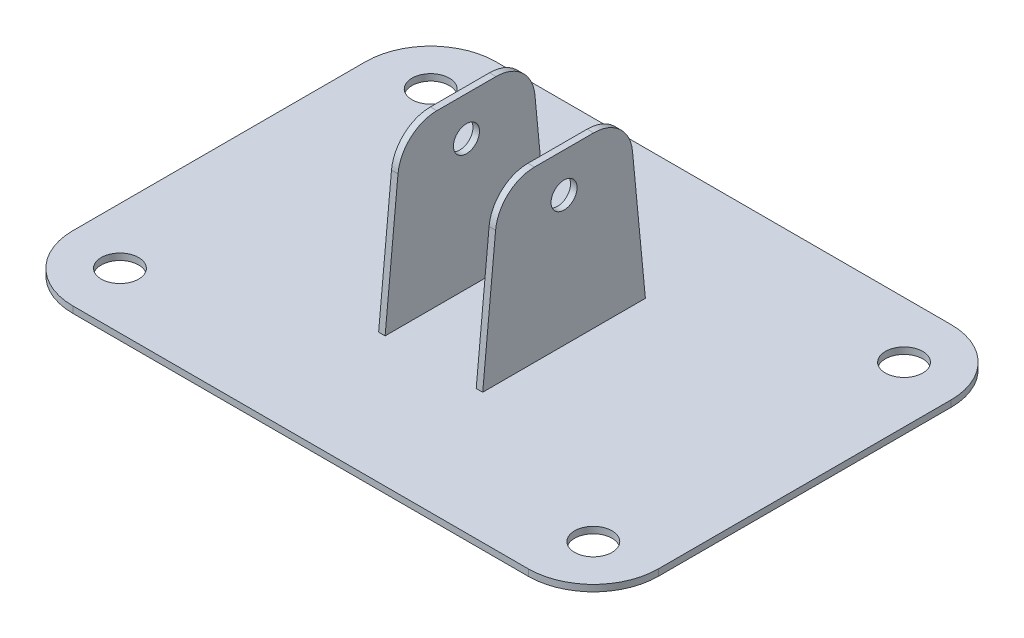
ISO-10303-21;
HEADER;
FILE_DESCRIPTION(('STEP AP214'),'2;1');
FILE_NAME('part.step','',(''),(''),'','','');
FILE_SCHEMA(('AUTOMOTIVE_DESIGN { 1 0 10303 214 1 1 1 1 }'));
ENDSEC;
DATA;
#1=APPLICATION_CONTEXT('core data for automotive mechanical design processes');
#2=APPLICATION_PROTOCOL_DEFINITION('international standard','automotive_design',2000,#1);
#3=PRODUCT_CONTEXT('',#1,'mechanical');
#4=PRODUCT('Part','Part','',(#3));
#5=PRODUCT_RELATED_PRODUCT_CATEGORY('part','',(#4));
#6=PRODUCT_DEFINITION_FORMATION('','',#4);
#7=PRODUCT_DEFINITION_CONTEXT('part definition',#1,'design');
#8=PRODUCT_DEFINITION('design','',#6,#7);
#9=PRODUCT_DEFINITION_SHAPE('','',#8);
#10=(LENGTH_UNIT() NAMED_UNIT(*) SI_UNIT(.MILLI.,.METRE.));
#11=(NAMED_UNIT(*) PLANE_ANGLE_UNIT() SI_UNIT($,.RADIAN.));
#12=(NAMED_UNIT(*) SI_UNIT($,.STERADIAN.) SOLID_ANGLE_UNIT());
#13=UNCERTAINTY_MEASURE_WITH_UNIT(LENGTH_MEASURE(1.E-05),#10,'distance_accuracy_value','');
#14=(GEOMETRIC_REPRESENTATION_CONTEXT(3) GLOBAL_UNCERTAINTY_ASSIGNED_CONTEXT((#13)) GLOBAL_UNIT_ASSIGNED_CONTEXT((#10,
#11,#12)) REPRESENTATION_CONTEXT('',''));
#15=CARTESIAN_POINT('',(0.,0.,0.));
#16=DIRECTION('',(0.,0.,1.));
#17=DIRECTION('',(1.,0.,0.));
#18=AXIS2_PLACEMENT_3D('',#15,#16,#17);
#19=CARTESIAN_POINT('',(0.,1.,0.));
#20=DIRECTION('',(0.,-1.,0.));
#21=DIRECTION('',(0.,0.,-1.));
#22=AXIS2_PLACEMENT_3D('',#19,#20,#21);
#23=PLANE('',#22);
#24=DIRECTION('',(0.,0.,-1.));
#25=VECTOR('',#24,1.);
#26=CARTESIAN_POINT('',(7.00000000000001,1.,12.5));
#27=LINE('',#26,#25);
#28=CARTESIAN_POINT('',(7.00000000000001,1.,12.5));
#29=VERTEX_POINT('',#28);
#30=CARTESIAN_POINT('',(7.00000000000001,1.,-12.5));
#31=VERTEX_POINT('',#30);
#32=EDGE_CURVE('E208',#29,#31,#27,.T.);
#33=ORIENTED_EDGE('',*,*,#32,.T.);
#34=DIRECTION('',(1.,0.,0.));
#35=VECTOR('',#34,1.);
#36=CARTESIAN_POINT('',(7.00000000000001,1.,-12.5));
#37=LINE('',#36,#35);
#38=CARTESIAN_POINT('',(8.00000000000001,1.,-12.5));
#39=VERTEX_POINT('',#38);
#40=EDGE_CURVE('E220',#31,#39,#37,.T.);
#41=ORIENTED_EDGE('',*,*,#40,.T.);
#42=DIRECTION('',(0.,0.,-1.));
#43=VECTOR('',#42,1.);
#44=CARTESIAN_POINT('',(8.00000000000001,1.,12.5));
#45=LINE('',#44,#43);
#46=CARTESIAN_POINT('',(8.00000000000001,1.,12.5));
#47=VERTEX_POINT('',#46);
#48=EDGE_CURVE('E205',#47,#39,#45,.T.);
#49=ORIENTED_EDGE('',*,*,#48,.F.);
#50=DIRECTION('',(1.,0.,0.));
#51=VECTOR('',#50,1.);
#52=CARTESIAN_POINT('',(7.00000000000001,1.,12.5));
#53=LINE('',#52,#51);
#54=EDGE_CURVE('E230',#29,#47,#53,.T.);
#55=ORIENTED_EDGE('',*,*,#54,.F.);
#56=EDGE_LOOP('',(#33,#41,#49,#55));
#57=FACE_BOUND('',#56,.T.);
#58=DIRECTION('',(0.,0.,1.));
#59=VECTOR('',#58,1.);
#60=CARTESIAN_POINT('',(-45.,1.,32.5));
#61=LINE('',#60,#59);
#62=CARTESIAN_POINT('',(-45.,1.,-22.5));
#63=VERTEX_POINT('',#62);
#64=CARTESIAN_POINT('',(-45.,1.,22.5));
#65=VERTEX_POINT('',#64);
#66=EDGE_CURVE('E267',#63,#65,#61,.T.);
#67=ORIENTED_EDGE('',*,*,#66,.T.);
#68=CARTESIAN_POINT('',(-35.,1.,22.5));
#69=DIRECTION('',(0.,-1.,0.));
#70=DIRECTION('',(0.,0.,-1.));
#71=AXIS2_PLACEMENT_3D('',#68,#69,#70);
#72=CIRCLE('',#71,10.);
#73=CARTESIAN_POINT('',(-35.,1.,32.5));
#74=VERTEX_POINT('',#73);
#75=EDGE_CURVE('E307',#65,#74,#72,.F.);
#76=ORIENTED_EDGE('',*,*,#75,.T.);
#77=DIRECTION('',(1.,0.,0.));
#78=VECTOR('',#77,1.);
#79=CARTESIAN_POINT('',(-45.,1.,32.5));
#80=LINE('',#79,#78);
#81=CARTESIAN_POINT('',(35.,1.,32.5));
#82=VERTEX_POINT('',#81);
#83=EDGE_CURVE('E270',#74,#82,#80,.T.);
#84=ORIENTED_EDGE('',*,*,#83,.T.);
#85=CARTESIAN_POINT('',(35.,1.,22.5));
#86=DIRECTION('',(0.,-1.,0.));
#87=DIRECTION('',(0.,0.,-1.));
#88=AXIS2_PLACEMENT_3D('',#85,#86,#87);
#89=CIRCLE('',#88,10.);
#90=CARTESIAN_POINT('',(45.,1.,22.5));
#91=VERTEX_POINT('',#90);
#92=EDGE_CURVE('E301',#82,#91,#89,.F.);
#93=ORIENTED_EDGE('',*,*,#92,.T.);
#94=DIRECTION('',(0.,0.,-1.));
#95=VECTOR('',#94,1.);
#96=CARTESIAN_POINT('',(45.,1.,32.5));
#97=LINE('',#96,#95);
#98=CARTESIAN_POINT('',(45.,1.,-22.5));
#99=VERTEX_POINT('',#98);
#100=EDGE_CURVE('E260',#91,#99,#97,.T.);
#101=ORIENTED_EDGE('',*,*,#100,.T.);
#102=CARTESIAN_POINT('',(35.,1.,-22.5));
#103=DIRECTION('',(0.,-1.,0.));
#104=DIRECTION('',(0.,0.,-1.));
#105=AXIS2_PLACEMENT_3D('',#102,#103,#104);
#106=CIRCLE('',#105,10.);
#107=CARTESIAN_POINT('',(35.,1.,-32.5));
#108=VERTEX_POINT('',#107);
#109=EDGE_CURVE('E303',#99,#108,#106,.F.);
#110=ORIENTED_EDGE('',*,*,#109,.T.);
#111=DIRECTION('',(-1.,0.,0.));
#112=VECTOR('',#111,1.);
#113=CARTESIAN_POINT('',(-45.,1.,-32.5));
#114=LINE('',#113,#112);
#115=CARTESIAN_POINT('',(-35.,1.,-32.5));
#116=VERTEX_POINT('',#115);
#117=EDGE_CURVE('E263',#108,#116,#114,.T.);
#118=ORIENTED_EDGE('',*,*,#117,.T.);
#119=CARTESIAN_POINT('',(-35.,1.,-22.5));
#120=DIRECTION('',(0.,-1.,0.));
#121=DIRECTION('',(0.,0.,-1.));
#122=AXIS2_PLACEMENT_3D('',#119,#120,#121);
#123=CIRCLE('',#122,10.);
#124=EDGE_CURVE('E305',#116,#63,#123,.F.);
#125=ORIENTED_EDGE('',*,*,#124,.T.);
#126=EDGE_LOOP('',(#67,#76,#84,#93,#101,#110,#118,#125));
#127=FACE_BOUND('',#126,.T.);
#128=CARTESIAN_POINT('',(-36.375,1.,-23.875));
#129=DIRECTION('',(0.,1.,0.));
#130=DIRECTION('',(0.,0.,1.));
#131=AXIS2_PLACEMENT_3D('',#128,#129,#130);
#132=CIRCLE('',#131,2.875);
#133=CARTESIAN_POINT('',(-36.375,1.,-21.));
#134=VERTEX_POINT('',#133);
#135=EDGE_CURVE('E254',#134,#134,#132,.T.);
#136=ORIENTED_EDGE('',*,*,#135,.F.);
#137=EDGE_LOOP('',(#136));
#138=FACE_BOUND('',#137,.T.);
#139=CARTESIAN_POINT('',(36.375,1.,-23.875));
#140=DIRECTION('',(0.,1.,0.));
#141=DIRECTION('',(0.,0.,-1.));
#142=AXIS2_PLACEMENT_3D('',#139,#140,#141);
#143=CIRCLE('',#142,2.875);
#144=CARTESIAN_POINT('',(36.375,1.,-26.75));
#145=VERTEX_POINT('',#144);
#146=EDGE_CURVE('E248',#145,#145,#143,.T.);
#147=ORIENTED_EDGE('',*,*,#146,.F.);
#148=EDGE_LOOP('',(#147));
#149=FACE_BOUND('',#148,.T.);
#150=CARTESIAN_POINT('',(36.375,1.,23.875));
#151=DIRECTION('',(0.,1.,0.));
#152=DIRECTION('',(0.,0.,1.));
#153=AXIS2_PLACEMENT_3D('',#150,#151,#152);
#154=CIRCLE('',#153,2.875);
#155=CARTESIAN_POINT('',(36.375,1.,26.75));
#156=VERTEX_POINT('',#155);
#157=EDGE_CURVE('E242',#156,#156,#154,.T.);
#158=ORIENTED_EDGE('',*,*,#157,.F.);
#159=EDGE_LOOP('',(#158));
#160=FACE_BOUND('',#159,.T.);
#161=CARTESIAN_POINT('',(-36.375,1.,23.875));
#162=DIRECTION('',(0.,1.,0.));
#163=DIRECTION('',(0.,0.,-1.));
#164=AXIS2_PLACEMENT_3D('',#161,#162,#163);
#165=CIRCLE('',#164,2.875);
#166=CARTESIAN_POINT('',(-36.375,1.,21.));
#167=VERTEX_POINT('',#166);
#168=EDGE_CURVE('E236',#167,#167,#165,.T.);
#169=ORIENTED_EDGE('',*,*,#168,.F.);
#170=EDGE_LOOP('',(#169));
#171=FACE_BOUND('',#170,.T.);
#172=DIRECTION('',(-1.,0.,0.));
#173=VECTOR('',#172,1.);
#174=CARTESIAN_POINT('',(-7.00000000000001,1.,-12.5));
#175=LINE('',#174,#173);
#176=CARTESIAN_POINT('',(-7.00000000000001,1.,-12.5));
#177=VERTEX_POINT('',#176);
#178=CARTESIAN_POINT('',(-8.00000000000001,1.,-12.5));
#179=VERTEX_POINT('',#178);
#180=EDGE_CURVE('E189',#177,#179,#175,.T.);
#181=ORIENTED_EDGE('',*,*,#180,.F.);
#182=DIRECTION('',(0.,0.,-1.));
#183=VECTOR('',#182,1.);
#184=CARTESIAN_POINT('',(-7.00000000000001,1.,12.5));
#185=LINE('',#184,#183);
#186=CARTESIAN_POINT('',(-7.00000000000001,1.,12.5));
#187=VERTEX_POINT('',#186);
#188=EDGE_CURVE('E176',#187,#177,#185,.T.);
#189=ORIENTED_EDGE('',*,*,#188,.F.);
#190=DIRECTION('',(-1.,0.,0.));
#191=VECTOR('',#190,1.);
#192=CARTESIAN_POINT('',(-7.00000000000001,1.,12.5));
#193=LINE('',#192,#191);
#194=CARTESIAN_POINT('',(-8.00000000000001,1.,12.5));
#195=VERTEX_POINT('',#194);
#196=EDGE_CURVE('E186',#187,#195,#193,.T.);
#197=ORIENTED_EDGE('',*,*,#196,.T.);
#198=DIRECTION('',(0.,0.,-1.));
#199=VECTOR('',#198,1.);
#200=CARTESIAN_POINT('',(-8.00000000000001,1.,12.5));
#201=LINE('',#200,#199);
#202=EDGE_CURVE('E363',#195,#179,#201,.T.);
#203=ORIENTED_EDGE('',*,*,#202,.T.);
#204=EDGE_LOOP('',(#181,#189,#197,#203));
#205=FACE_BOUND('',#204,.T.);
#206=ADVANCED_FACE('F33',(#57,#127,#138,#149,#160,#171,#205),#23,.F.);
#207=CARTESIAN_POINT('',(0.,0.,0.));
#208=DIRECTION('',(0.,-1.,0.));
#209=DIRECTION('',(0.,0.,-1.));
#210=AXIS2_PLACEMENT_3D('',#207,#208,#209);
#211=PLANE('',#210);
#212=CARTESIAN_POINT('',(36.375,0.,23.875));
#213=DIRECTION('',(0.,1.,0.));
#214=DIRECTION('',(0.,0.,1.));
#215=AXIS2_PLACEMENT_3D('',#212,#213,#214);
#216=CIRCLE('',#215,2.875);
#217=CARTESIAN_POINT('',(36.375,0.,26.75));
#218=VERTEX_POINT('',#217);
#219=EDGE_CURVE('E239',#218,#218,#216,.T.);
#220=ORIENTED_EDGE('',*,*,#219,.T.);
#221=EDGE_LOOP('',(#220));
#222=FACE_BOUND('',#221,.T.);
#223=CARTESIAN_POINT('',(-36.375,0.,-23.875));
#224=DIRECTION('',(0.,1.,0.));
#225=DIRECTION('',(0.,0.,1.));
#226=AXIS2_PLACEMENT_3D('',#223,#224,#225);
#227=CIRCLE('',#226,2.875);
#228=CARTESIAN_POINT('',(-36.375,0.,-21.));
#229=VERTEX_POINT('',#228);
#230=EDGE_CURVE('E251',#229,#229,#227,.T.);
#231=ORIENTED_EDGE('',*,*,#230,.T.);
#232=EDGE_LOOP('',(#231));
#233=FACE_BOUND('',#232,.T.);
#234=DIRECTION('',(1.,0.,0.));
#235=VECTOR('',#234,1.);
#236=CARTESIAN_POINT('',(-45.,0.,32.5));
#237=LINE('',#236,#235);
#238=CARTESIAN_POINT('',(-35.,0.,32.5));
#239=VERTEX_POINT('',#238);
#240=CARTESIAN_POINT('',(35.,0.,32.5));
#241=VERTEX_POINT('',#240);
#242=EDGE_CURVE('E264',#239,#241,#237,.T.);
#243=ORIENTED_EDGE('',*,*,#242,.F.);
#244=CARTESIAN_POINT('',(-35.,0.,22.5));
#245=DIRECTION('',(0.,-1.,0.));
#246=DIRECTION('',(0.,0.,-1.));
#247=AXIS2_PLACEMENT_3D('',#244,#245,#246);
#248=CIRCLE('',#247,10.);
#249=CARTESIAN_POINT('',(-45.,0.,22.5));
#250=VERTEX_POINT('',#249);
#251=EDGE_CURVE('E294',#239,#250,#248,.T.);
#252=ORIENTED_EDGE('',*,*,#251,.T.);
#253=DIRECTION('',(0.,0.,1.));
#254=VECTOR('',#253,1.);
#255=CARTESIAN_POINT('',(-45.,0.,32.5));
#256=LINE('',#255,#254);
#257=CARTESIAN_POINT('',(-45.,0.,-22.5));
#258=VERTEX_POINT('',#257);
#259=EDGE_CURVE('E279',#258,#250,#256,.T.);
#260=ORIENTED_EDGE('',*,*,#259,.F.);
#261=CARTESIAN_POINT('',(-35.,0.,-22.5));
#262=DIRECTION('',(0.,-1.,0.));
#263=DIRECTION('',(0.,0.,-1.));
#264=AXIS2_PLACEMENT_3D('',#261,#262,#263);
#265=CIRCLE('',#264,10.);
#266=CARTESIAN_POINT('',(-35.,0.,-32.5));
#267=VERTEX_POINT('',#266);
#268=EDGE_CURVE('E292',#258,#267,#265,.T.);
#269=ORIENTED_EDGE('',*,*,#268,.T.);
#270=DIRECTION('',(-1.,0.,0.));
#271=VECTOR('',#270,1.);
#272=CARTESIAN_POINT('',(-45.,0.,-32.5));
#273=LINE('',#272,#271);
#274=CARTESIAN_POINT('',(35.,0.,-32.5));
#275=VERTEX_POINT('',#274);
#276=EDGE_CURVE('E276',#275,#267,#273,.T.);
#277=ORIENTED_EDGE('',*,*,#276,.F.);
#278=CARTESIAN_POINT('',(35.,0.,-22.5));
#279=DIRECTION('',(0.,-1.,0.));
#280=DIRECTION('',(0.,0.,-1.));
#281=AXIS2_PLACEMENT_3D('',#278,#279,#280);
#282=CIRCLE('',#281,10.);
#283=CARTESIAN_POINT('',(45.,0.,-22.5));
#284=VERTEX_POINT('',#283);
#285=EDGE_CURVE('E290',#275,#284,#282,.T.);
#286=ORIENTED_EDGE('',*,*,#285,.T.);
#287=DIRECTION('',(0.,0.,-1.));
#288=VECTOR('',#287,1.);
#289=CARTESIAN_POINT('',(45.,0.,32.5));
#290=LINE('',#289,#288);
#291=CARTESIAN_POINT('',(45.,0.,22.5));
#292=VERTEX_POINT('',#291);
#293=EDGE_CURVE('E257',#292,#284,#290,.T.);
#294=ORIENTED_EDGE('',*,*,#293,.F.);
#295=CARTESIAN_POINT('',(35.,0.,22.5));
#296=DIRECTION('',(0.,-1.,0.));
#297=DIRECTION('',(0.,0.,-1.));
#298=AXIS2_PLACEMENT_3D('',#295,#296,#297);
#299=CIRCLE('',#298,10.);
#300=EDGE_CURVE('E288',#292,#241,#299,.T.);
#301=ORIENTED_EDGE('',*,*,#300,.T.);
#302=EDGE_LOOP('',(#243,#252,#260,#269,#277,#286,#294,#301));
#303=FACE_BOUND('',#302,.T.);
#304=CARTESIAN_POINT('',(36.375,0.,-23.875));
#305=DIRECTION('',(0.,1.,0.));
#306=DIRECTION('',(0.,0.,-1.));
#307=AXIS2_PLACEMENT_3D('',#304,#305,#306);
#308=CIRCLE('',#307,2.875);
#309=CARTESIAN_POINT('',(36.375,0.,-26.75));
#310=VERTEX_POINT('',#309);
#311=EDGE_CURVE('E245',#310,#310,#308,.T.);
#312=ORIENTED_EDGE('',*,*,#311,.T.);
#313=EDGE_LOOP('',(#312));
#314=FACE_BOUND('',#313,.T.);
#315=CARTESIAN_POINT('',(-36.375,0.,23.875));
#316=DIRECTION('',(0.,1.,0.));
#317=DIRECTION('',(0.,0.,-1.));
#318=AXIS2_PLACEMENT_3D('',#315,#316,#317);
#319=CIRCLE('',#318,2.875);
#320=CARTESIAN_POINT('',(-36.375,0.,21.));
#321=VERTEX_POINT('',#320);
#322=EDGE_CURVE('E233',#321,#321,#319,.T.);
#323=ORIENTED_EDGE('',*,*,#322,.T.);
#324=EDGE_LOOP('',(#323));
#325=FACE_BOUND('',#324,.T.);
#326=ADVANCED_FACE('F387',(#222,#233,#303,#314,#325),#211,.T.);
#327=CARTESIAN_POINT('',(45.,1.,32.5));
#328=DIRECTION('',(-1.,0.,0.));
#329=DIRECTION('',(0.,0.,1.));
#330=AXIS2_PLACEMENT_3D('',#327,#328,#329);
#331=PLANE('',#330);
#332=ORIENTED_EDGE('',*,*,#293,.T.);
#333=DIRECTION('',(0.,-1.,0.));
#334=VECTOR('',#333,1.);
#335=CARTESIAN_POINT('',(45.,1.,-22.5));
#336=LINE('',#335,#334);
#337=EDGE_CURVE('E317',#284,#99,#336,.F.);
#338=ORIENTED_EDGE('',*,*,#337,.T.);
#339=ORIENTED_EDGE('',*,*,#100,.F.);
#340=DIRECTION('',(0.,-1.,0.));
#341=VECTOR('',#340,1.);
#342=CARTESIAN_POINT('',(45.,1.,22.5));
#343=LINE('',#342,#341);
#344=EDGE_CURVE('E314',#91,#292,#343,.T.);
#345=ORIENTED_EDGE('',*,*,#344,.T.);
#346=EDGE_LOOP('',(#332,#338,#339,#345));
#347=FACE_BOUND('',#346,.T.);
#348=ADVANCED_FACE('F393',(#347),#331,.F.);
#349=CARTESIAN_POINT('',(-45.,1.,-32.5));
#350=DIRECTION('',(0.,0.,1.));
#351=DIRECTION('',(1.,0.,0.));
#352=AXIS2_PLACEMENT_3D('',#349,#350,#351);
#353=PLANE('',#352);
#354=ORIENTED_EDGE('',*,*,#276,.T.);
#355=DIRECTION('',(0.,-1.,0.));
#356=VECTOR('',#355,1.);
#357=CARTESIAN_POINT('',(-35.,1.,-32.5));
#358=LINE('',#357,#356);
#359=EDGE_CURVE('E312',#267,#116,#358,.F.);
#360=ORIENTED_EDGE('',*,*,#359,.T.);
#361=ORIENTED_EDGE('',*,*,#117,.F.);
#362=DIRECTION('',(0.,-1.,0.));
#363=VECTOR('',#362,1.);
#364=CARTESIAN_POINT('',(35.,1.,-32.5));
#365=LINE('',#364,#363);
#366=EDGE_CURVE('E309',#108,#275,#365,.T.);
#367=ORIENTED_EDGE('',*,*,#366,.T.);
#368=EDGE_LOOP('',(#354,#360,#361,#367));
#369=FACE_BOUND('',#368,.T.);
#370=ADVANCED_FACE('F408',(#369),#353,.F.);
#371=CARTESIAN_POINT('',(-45.,1.,32.5));
#372=DIRECTION('',(1.,0.,0.));
#373=DIRECTION('',(0.,0.,-1.));
#374=AXIS2_PLACEMENT_3D('',#371,#372,#373);
#375=PLANE('',#374);
#376=ORIENTED_EDGE('',*,*,#259,.T.);
#377=DIRECTION('',(0.,-1.,0.));
#378=VECTOR('',#377,1.);
#379=CARTESIAN_POINT('',(-45.,1.,22.5));
#380=LINE('',#379,#378);
#381=EDGE_CURVE('E299',#250,#65,#380,.F.);
#382=ORIENTED_EDGE('',*,*,#381,.T.);
#383=ORIENTED_EDGE('',*,*,#66,.F.);
#384=DIRECTION('',(0.,-1.,0.));
#385=VECTOR('',#384,1.);
#386=CARTESIAN_POINT('',(-45.,1.,-22.5));
#387=LINE('',#386,#385);
#388=EDGE_CURVE('E296',#63,#258,#387,.T.);
#389=ORIENTED_EDGE('',*,*,#388,.T.);
#390=EDGE_LOOP('',(#376,#382,#383,#389));
#391=FACE_BOUND('',#390,.T.);
#392=ADVANCED_FACE('F404',(#391),#375,.F.);
#393=CARTESIAN_POINT('',(-45.,1.,32.5));
#394=DIRECTION('',(0.,0.,-1.));
#395=DIRECTION('',(-1.,0.,0.));
#396=AXIS2_PLACEMENT_3D('',#393,#394,#395);
#397=PLANE('',#396);
#398=ORIENTED_EDGE('',*,*,#83,.F.);
#399=DIRECTION('',(0.,-1.,0.));
#400=VECTOR('',#399,1.);
#401=CARTESIAN_POINT('',(-35.,1.,32.5));
#402=LINE('',#401,#400);
#403=EDGE_CURVE('E285',#74,#239,#402,.T.);
#404=ORIENTED_EDGE('',*,*,#403,.T.);
#405=ORIENTED_EDGE('',*,*,#242,.T.);
#406=DIRECTION('',(0.,-1.,0.));
#407=VECTOR('',#406,1.);
#408=CARTESIAN_POINT('',(35.,1.,32.5));
#409=LINE('',#408,#407);
#410=EDGE_CURVE('E273',#241,#82,#409,.F.);
#411=ORIENTED_EDGE('',*,*,#410,.T.);
#412=EDGE_LOOP('',(#398,#404,#405,#411));
#413=FACE_BOUND('',#412,.T.);
#414=ADVANCED_FACE('F401',(#413),#397,.F.);
#415=CARTESIAN_POINT('',(-36.375,1.,-23.875));
#416=DIRECTION('',(0.,-1.,0.));
#417=DIRECTION('',(0.,0.,-1.));
#418=AXIS2_PLACEMENT_3D('',#415,#416,#417);
#419=CYLINDRICAL_SURFACE('',#418,2.875);
#420=ORIENTED_EDGE('',*,*,#135,.T.);
#421=EDGE_LOOP('',(#420));
#422=FACE_BOUND('',#421,.T.);
#423=ORIENTED_EDGE('',*,*,#230,.F.);
#424=EDGE_LOOP('',(#423));
#425=FACE_BOUND('',#424,.T.);
#426=ADVANCED_FACE('F398',(#422,#425),#419,.F.);
#427=CARTESIAN_POINT('',(36.375,1.,-23.875));
#428=DIRECTION('',(0.,-1.,0.));
#429=DIRECTION('',(0.,0.,-1.));
#430=AXIS2_PLACEMENT_3D('',#427,#428,#429);
#431=CYLINDRICAL_SURFACE('',#430,2.875);
#432=ORIENTED_EDGE('',*,*,#146,.T.);
#433=EDGE_LOOP('',(#432));
#434=FACE_BOUND('',#433,.T.);
#435=ORIENTED_EDGE('',*,*,#311,.F.);
#436=EDGE_LOOP('',(#435));
#437=FACE_BOUND('',#436,.T.);
#438=ADVANCED_FACE('F481',(#434,#437),#431,.F.);
#439=CARTESIAN_POINT('',(36.375,1.,23.875));
#440=DIRECTION('',(0.,-1.,0.));
#441=DIRECTION('',(0.,0.,-1.));
#442=AXIS2_PLACEMENT_3D('',#439,#440,#441);
#443=CYLINDRICAL_SURFACE('',#442,2.875);
#444=ORIENTED_EDGE('',*,*,#157,.T.);
#445=EDGE_LOOP('',(#444));
#446=FACE_BOUND('',#445,.T.);
#447=ORIENTED_EDGE('',*,*,#219,.F.);
#448=EDGE_LOOP('',(#447));
#449=FACE_BOUND('',#448,.T.);
#450=ADVANCED_FACE('F478',(#446,#449),#443,.F.);
#451=CARTESIAN_POINT('',(-36.375,1.,23.875));
#452=DIRECTION('',(0.,-1.,0.));
#453=DIRECTION('',(0.,0.,-1.));
#454=AXIS2_PLACEMENT_3D('',#451,#452,#453);
#455=CYLINDRICAL_SURFACE('',#454,2.875);
#456=ORIENTED_EDGE('',*,*,#168,.T.);
#457=EDGE_LOOP('',(#456));
#458=FACE_BOUND('',#457,.T.);
#459=ORIENTED_EDGE('',*,*,#322,.F.);
#460=EDGE_LOOP('',(#459));
#461=FACE_BOUND('',#460,.T.);
#462=ADVANCED_FACE('F420',(#458,#461),#455,.F.);
#463=CARTESIAN_POINT('',(-35.,1.,22.5));
#464=DIRECTION('',(0.,-1.,0.));
#465=DIRECTION('',(0.,0.,-1.));
#466=AXIS2_PLACEMENT_3D('',#463,#464,#465);
#467=CYLINDRICAL_SURFACE('',#466,10.);
#468=ORIENTED_EDGE('',*,*,#75,.F.);
#469=ORIENTED_EDGE('',*,*,#381,.F.);
#470=ORIENTED_EDGE('',*,*,#251,.F.);
#471=ORIENTED_EDGE('',*,*,#403,.F.);
#472=EDGE_LOOP('',(#468,#469,#470,#471));
#473=FACE_BOUND('',#472,.T.);
#474=ADVANCED_FACE('F416',(#473),#467,.T.);
#475=CARTESIAN_POINT('',(-35.,1.,-22.5));
#476=DIRECTION('',(0.,-1.,0.));
#477=DIRECTION('',(0.,0.,-1.));
#478=AXIS2_PLACEMENT_3D('',#475,#476,#477);
#479=CYLINDRICAL_SURFACE('',#478,10.);
#480=ORIENTED_EDGE('',*,*,#124,.F.);
#481=ORIENTED_EDGE('',*,*,#359,.F.);
#482=ORIENTED_EDGE('',*,*,#268,.F.);
#483=ORIENTED_EDGE('',*,*,#388,.F.);
#484=EDGE_LOOP('',(#480,#481,#482,#483));
#485=FACE_BOUND('',#484,.T.);
#486=ADVANCED_FACE('F419',(#485),#479,.T.);
#487=CARTESIAN_POINT('',(35.,1.,-22.5));
#488=DIRECTION('',(0.,-1.,0.));
#489=DIRECTION('',(0.,0.,-1.));
#490=AXIS2_PLACEMENT_3D('',#487,#488,#489);
#491=CYLINDRICAL_SURFACE('',#490,10.);
#492=ORIENTED_EDGE('',*,*,#109,.F.);
#493=ORIENTED_EDGE('',*,*,#337,.F.);
#494=ORIENTED_EDGE('',*,*,#285,.F.);
#495=ORIENTED_EDGE('',*,*,#366,.F.);
#496=EDGE_LOOP('',(#492,#493,#494,#495));
#497=FACE_BOUND('',#496,.T.);
#498=ADVANCED_FACE('F424',(#497),#491,.T.);
#499=CARTESIAN_POINT('',(35.,1.,22.5));
#500=DIRECTION('',(0.,-1.,0.));
#501=DIRECTION('',(0.,0.,-1.));
#502=AXIS2_PLACEMENT_3D('',#499,#500,#501);
#503=CYLINDRICAL_SURFACE('',#502,10.);
#504=ORIENTED_EDGE('',*,*,#92,.F.);
#505=ORIENTED_EDGE('',*,*,#410,.F.);
#506=ORIENTED_EDGE('',*,*,#300,.F.);
#507=ORIENTED_EDGE('',*,*,#344,.F.);
#508=EDGE_LOOP('',(#504,#505,#506,#507));
#509=FACE_BOUND('',#508,.T.);
#510=ADVANCED_FACE('F428',(#509),#503,.T.);
#511=CARTESIAN_POINT('',(7.00000000000001,1.,12.5));
#512=DIRECTION('',(0.,0.0957124066442578,0.995409029100281));
#513=DIRECTION('',(0.,-0.995409029100281,0.0957124066442578));
#514=AXIS2_PLACEMENT_3D('',#511,#512,#513);
#515=PLANE('',#514);
#516=DIRECTION('',(0.,-0.995409029100281,0.0957124066442578));
#517=VECTOR('',#516,1.);
#518=CARTESIAN_POINT('',(8.00000000000001,1.,12.5));
#519=LINE('',#518,#517);
#520=CARTESIAN_POINT('',(8.00000000000001,21.5742744398655,10.5217043807822));
#521=VERTEX_POINT('',#520);
#522=EDGE_CURVE('E212',#521,#47,#519,.T.);
#523=ORIENTED_EDGE('',*,*,#522,.F.);
#524=DIRECTION('',(1.,0.,0.));
#525=VECTOR('',#524,1.);
#526=CARTESIAN_POINT('',(7.00000000000001,21.5742744398655,10.5217043807822));
#527=LINE('',#526,#525);
#528=CARTESIAN_POINT('',(7.00000000000001,21.5742744398655,10.5217043807822));
#529=VERTEX_POINT('',#528);
#530=EDGE_CURVE('E328',#521,#529,#527,.F.);
#531=ORIENTED_EDGE('',*,*,#530,.T.);
#532=DIRECTION('',(0.,-0.995409029100281,0.0957124066442578));
#533=VECTOR('',#532,1.);
#534=CARTESIAN_POINT('',(7.00000000000001,1.,12.5));
#535=LINE('',#534,#533);
#536=EDGE_CURVE('E218',#529,#29,#535,.T.);
#537=ORIENTED_EDGE('',*,*,#536,.T.);
#538=ORIENTED_EDGE('',*,*,#54,.T.);
#539=EDGE_LOOP('',(#523,#531,#537,#538));
#540=FACE_BOUND('',#539,.T.);
#541=ADVANCED_FACE('F432',(#540),#515,.T.);
#542=CARTESIAN_POINT('',(7.00000000000001,27.,10.));
#543=DIRECTION('',(0.,1.,0.));
#544=DIRECTION('',(0.,0.,1.));
#545=AXIS2_PLACEMENT_3D('',#542,#543,#544);
#546=PLANE('',#545);
#547=DIRECTION('',(0.,0.,1.));
#548=VECTOR('',#547,1.);
#549=CARTESIAN_POINT('',(7.00000000000001,27.,10.));
#550=LINE('',#549,#548);
#551=CARTESIAN_POINT('',(7.00000000000001,27.,-4.54925020618047));
#552=VERTEX_POINT('',#551);
#553=CARTESIAN_POINT('',(7.00000000000001,27.,4.54925020618047));
#554=VERTEX_POINT('',#553);
#555=EDGE_CURVE('E215',#552,#554,#550,.T.);
#556=ORIENTED_EDGE('',*,*,#555,.T.);
#557=DIRECTION('',(1.,0.,0.));
#558=VECTOR('',#557,1.);
#559=CARTESIAN_POINT('',(7.00000000000001,27.,4.54925020618047));
#560=LINE('',#559,#558);
#561=CARTESIAN_POINT('',(8.00000000000001,27.,4.54925020618047));
#562=VERTEX_POINT('',#561);
#563=EDGE_CURVE('E321',#554,#562,#560,.T.);
#564=ORIENTED_EDGE('',*,*,#563,.T.);
#565=DIRECTION('',(0.,0.,1.));
#566=VECTOR('',#565,1.);
#567=CARTESIAN_POINT('',(8.00000000000001,27.,10.));
#568=LINE('',#567,#566);
#569=CARTESIAN_POINT('',(8.00000000000001,27.,-4.54925020618047));
#570=VERTEX_POINT('',#569);
#571=EDGE_CURVE('E226',#570,#562,#568,.T.);
#572=ORIENTED_EDGE('',*,*,#571,.F.);
#573=DIRECTION('',(1.,0.,0.));
#574=VECTOR('',#573,1.);
#575=CARTESIAN_POINT('',(7.00000000000001,27.,-4.54925020618047));
#576=LINE('',#575,#574);
#577=EDGE_CURVE('E319',#570,#552,#576,.F.);
#578=ORIENTED_EDGE('',*,*,#577,.T.);
#579=EDGE_LOOP('',(#556,#564,#572,#578));
#580=FACE_BOUND('',#579,.T.);
#581=ADVANCED_FACE('F468',(#580),#546,.T.);
#582=CARTESIAN_POINT('',(7.00000000000001,1.,-12.5));
#583=DIRECTION('',(0.,0.0957124066442578,-0.995409029100281));
#584=DIRECTION('',(0.,0.995409029100281,0.0957124066442578));
#585=AXIS2_PLACEMENT_3D('',#582,#583,#584);
#586=PLANE('',#585);
#587=DIRECTION('',(0.,0.995409029100281,0.0957124066442578));
#588=VECTOR('',#587,1.);
#589=CARTESIAN_POINT('',(7.00000000000001,1.,-12.5));
#590=LINE('',#589,#588);
#591=CARTESIAN_POINT('',(7.00000000000001,21.5742744398655,-10.5217043807822));
#592=VERTEX_POINT('',#591);
#593=EDGE_CURVE('E211',#31,#592,#590,.T.);
#594=ORIENTED_EDGE('',*,*,#593,.T.);
#595=DIRECTION('',(1.,0.,0.));
#596=VECTOR('',#595,1.);
#597=CARTESIAN_POINT('',(7.00000000000001,21.5742744398655,-10.5217043807822));
#598=LINE('',#597,#596);
#599=CARTESIAN_POINT('',(8.00000000000001,21.5742744398655,-10.5217043807822));
#600=VERTEX_POINT('',#599);
#601=EDGE_CURVE('E334',#592,#600,#598,.T.);
#602=ORIENTED_EDGE('',*,*,#601,.T.);
#603=DIRECTION('',(0.,0.995409029100281,0.0957124066442578));
#604=VECTOR('',#603,1.);
#605=CARTESIAN_POINT('',(8.00000000000001,1.,-12.5));
#606=LINE('',#605,#604);
#607=EDGE_CURVE('E223',#39,#600,#606,.T.);
#608=ORIENTED_EDGE('',*,*,#607,.F.);
#609=ORIENTED_EDGE('',*,*,#40,.F.);
#610=EDGE_LOOP('',(#594,#602,#608,#609));
#611=FACE_BOUND('',#610,.T.);
#612=ADVANCED_FACE('F461',(#611),#586,.T.);
#613=CARTESIAN_POINT('',(7.00000000000001,0.,0.));
#614=DIRECTION('',(1.,0.,0.));
#615=DIRECTION('',(0.,0.,-1.));
#616=AXIS2_PLACEMENT_3D('',#613,#614,#615);
#617=PLANE('',#616);
#618=CARTESIAN_POINT('',(7.00000000000001,21.,0.));
#619=DIRECTION('',(1.,0.,0.));
#620=DIRECTION('',(0.,0.,-1.));
#621=AXIS2_PLACEMENT_3D('',#618,#619,#620);
#622=CIRCLE('',#621,2.);
#623=CARTESIAN_POINT('',(7.00000000000001,21.,-2.));
#624=VERTEX_POINT('',#623);
#625=EDGE_CURVE('E202',#624,#624,#622,.T.);
#626=ORIENTED_EDGE('',*,*,#625,.T.);
#627=EDGE_LOOP('',(#626));
#628=FACE_BOUND('',#627,.T.);
#629=ORIENTED_EDGE('',*,*,#536,.F.);
#630=CARTESIAN_POINT('',(7.00000000000001,21.,4.54925020618047));
#631=DIRECTION('',(1.,0.,0.));
#632=DIRECTION('',(0.,0.,-1.));
#633=AXIS2_PLACEMENT_3D('',#630,#631,#632);
#634=CIRCLE('',#633,6.);
#635=EDGE_CURVE('E332',#529,#554,#634,.F.);
#636=ORIENTED_EDGE('',*,*,#635,.T.);
#637=ORIENTED_EDGE('',*,*,#555,.F.);
#638=CARTESIAN_POINT('',(7.00000000000001,21.,-4.54925020618047));
#639=DIRECTION('',(1.,0.,0.));
#640=DIRECTION('',(0.,0.,-1.));
#641=AXIS2_PLACEMENT_3D('',#638,#639,#640);
#642=CIRCLE('',#641,6.);
#643=EDGE_CURVE('E330',#552,#592,#642,.F.);
#644=ORIENTED_EDGE('',*,*,#643,.T.);
#645=ORIENTED_EDGE('',*,*,#593,.F.);
#646=ORIENTED_EDGE('',*,*,#32,.F.);
#647=EDGE_LOOP('',(#629,#636,#637,#644,#645,#646));
#648=FACE_BOUND('',#647,.T.);
#649=ADVANCED_FACE('F458',(#628,#648),#617,.F.);
#650=CARTESIAN_POINT('',(8.00000000000001,0.,0.));
#651=DIRECTION('',(1.,0.,0.));
#652=DIRECTION('',(0.,0.,-1.));
#653=AXIS2_PLACEMENT_3D('',#650,#651,#652);
#654=PLANE('',#653);
#655=CARTESIAN_POINT('',(8.00000000000001,21.,0.));
#656=DIRECTION('',(1.,0.,0.));
#657=DIRECTION('',(0.,0.,-1.));
#658=AXIS2_PLACEMENT_3D('',#655,#656,#657);
#659=CIRCLE('',#658,2.);
#660=CARTESIAN_POINT('',(8.00000000000001,21.,-2.));
#661=VERTEX_POINT('',#660);
#662=EDGE_CURVE('E197',#661,#661,#659,.T.);
#663=ORIENTED_EDGE('',*,*,#662,.F.);
#664=EDGE_LOOP('',(#663));
#665=FACE_BOUND('',#664,.T.);
#666=ORIENTED_EDGE('',*,*,#571,.T.);
#667=CARTESIAN_POINT('',(8.00000000000001,21.,4.54925020618047));
#668=DIRECTION('',(1.,0.,0.));
#669=DIRECTION('',(0.,0.,-1.));
#670=AXIS2_PLACEMENT_3D('',#667,#668,#669);
#671=CIRCLE('',#670,6.);
#672=EDGE_CURVE('E326',#562,#521,#671,.T.);
#673=ORIENTED_EDGE('',*,*,#672,.T.);
#674=ORIENTED_EDGE('',*,*,#522,.T.);
#675=ORIENTED_EDGE('',*,*,#48,.T.);
#676=ORIENTED_EDGE('',*,*,#607,.T.);
#677=CARTESIAN_POINT('',(8.00000000000001,21.,-4.54925020618047));
#678=DIRECTION('',(1.,0.,0.));
#679=DIRECTION('',(0.,0.,-1.));
#680=AXIS2_PLACEMENT_3D('',#677,#678,#679);
#681=CIRCLE('',#680,6.);
#682=EDGE_CURVE('E324',#600,#570,#681,.T.);
#683=ORIENTED_EDGE('',*,*,#682,.T.);
#684=EDGE_LOOP('',(#666,#673,#674,#675,#676,#683));
#685=FACE_BOUND('',#684,.T.);
#686=ADVANCED_FACE('F456',(#665,#685),#654,.T.);
#687=CARTESIAN_POINT('',(7.00000000000001,21.,0.));
#688=DIRECTION('',(1.,0.,0.));
#689=DIRECTION('',(0.,0.,-1.));
#690=AXIS2_PLACEMENT_3D('',#687,#688,#689);
#691=CYLINDRICAL_SURFACE('',#690,2.);
#692=ORIENTED_EDGE('',*,*,#625,.F.);
#693=EDGE_LOOP('',(#692));
#694=FACE_BOUND('',#693,.T.);
#695=ORIENTED_EDGE('',*,*,#662,.T.);
#696=EDGE_LOOP('',(#695));
#697=FACE_BOUND('',#696,.T.);
#698=ADVANCED_FACE('F435',(#694,#697),#691,.F.);
#699=CARTESIAN_POINT('',(7.00000000000001,21.,4.54925020618047));
#700=DIRECTION('',(1.,0.,0.));
#701=DIRECTION('',(0.,0.,-1.));
#702=AXIS2_PLACEMENT_3D('',#699,#700,#701);
#703=CYLINDRICAL_SURFACE('',#702,6.);
#704=ORIENTED_EDGE('',*,*,#635,.F.);
#705=ORIENTED_EDGE('',*,*,#530,.F.);
#706=ORIENTED_EDGE('',*,*,#672,.F.);
#707=ORIENTED_EDGE('',*,*,#563,.F.);
#708=EDGE_LOOP('',(#704,#705,#706,#707));
#709=FACE_BOUND('',#708,.T.);
#710=ADVANCED_FACE('F382',(#709),#703,.T.);
#711=CARTESIAN_POINT('',(7.00000000000001,21.,-4.54925020618047));
#712=DIRECTION('',(1.,0.,0.));
#713=DIRECTION('',(0.,0.,-1.));
#714=AXIS2_PLACEMENT_3D('',#711,#712,#713);
#715=CYLINDRICAL_SURFACE('',#714,6.);
#716=ORIENTED_EDGE('',*,*,#643,.F.);
#717=ORIENTED_EDGE('',*,*,#577,.F.);
#718=ORIENTED_EDGE('',*,*,#682,.F.);
#719=ORIENTED_EDGE('',*,*,#601,.F.);
#720=EDGE_LOOP('',(#716,#717,#718,#719));
#721=FACE_BOUND('',#720,.T.);
#722=ADVANCED_FACE('F375',(#721),#715,.T.);
#723=CARTESIAN_POINT('',(-7.00000000000001,0.,0.));
#724=DIRECTION('',(-1.,0.,0.));
#725=DIRECTION('',(0.,0.,-1.));
#726=AXIS2_PLACEMENT_3D('',#723,#724,#725);
#727=PLANE('',#726);
#728=DIRECTION('',(0.,0.,1.));
#729=VECTOR('',#728,1.);
#730=CARTESIAN_POINT('',(-7.00000000000001,27.,10.));
#731=LINE('',#730,#729);
#732=CARTESIAN_POINT('',(-7.00000000000001,27.,-4.54925020618047));
#733=VERTEX_POINT('',#732);
#734=CARTESIAN_POINT('',(-7.00000000000001,27.,4.54925020618047));
#735=VERTEX_POINT('',#734);
#736=EDGE_CURVE('E182',#733,#735,#731,.T.);
#737=ORIENTED_EDGE('',*,*,#736,.T.);
#738=CARTESIAN_POINT('',(-7.00000000000001,21.,4.54925020618047));
#739=DIRECTION('',(-1.,0.,0.));
#740=DIRECTION('',(0.,0.,1.));
#741=AXIS2_PLACEMENT_3D('',#738,#739,#740);
#742=CIRCLE('',#741,6.);
#743=CARTESIAN_POINT('',(-7.00000000000001,21.5742744398655,10.5217043807822));
#744=VERTEX_POINT('',#743);
#745=EDGE_CURVE('E41',#735,#744,#742,.F.);
#746=ORIENTED_EDGE('',*,*,#745,.T.);
#747=DIRECTION('',(0.,-0.995409029100281,0.0957124066442578));
#748=VECTOR('',#747,1.);
#749=CARTESIAN_POINT('',(-7.00000000000001,1.,12.5));
#750=LINE('',#749,#748);
#751=EDGE_CURVE('E172',#744,#187,#750,.T.);
#752=ORIENTED_EDGE('',*,*,#751,.T.);
#753=ORIENTED_EDGE('',*,*,#188,.T.);
#754=DIRECTION('',(0.,0.995409029100281,0.0957124066442578));
#755=VECTOR('',#754,1.);
#756=CARTESIAN_POINT('',(-7.00000000000001,1.,-12.5));
#757=LINE('',#756,#755);
#758=CARTESIAN_POINT('',(-7.00000000000001,21.5742744398655,-10.5217043807822));
#759=VERTEX_POINT('',#758);
#760=EDGE_CURVE('E195',#177,#759,#757,.T.);
#761=ORIENTED_EDGE('',*,*,#760,.T.);
#762=CARTESIAN_POINT('',(-7.00000000000001,21.,-4.54925020618047));
#763=DIRECTION('',(-1.,0.,0.));
#764=DIRECTION('',(0.,0.,1.));
#765=AXIS2_PLACEMENT_3D('',#762,#763,#764);
#766=CIRCLE('',#765,6.);
#767=EDGE_CURVE('E347',#759,#733,#766,.F.);
#768=ORIENTED_EDGE('',*,*,#767,.T.);
#769=EDGE_LOOP('',(#737,#746,#752,#753,#761,#768));
#770=FACE_BOUND('',#769,.T.);
#771=CARTESIAN_POINT('',(-7.00000000000001,21.,0.));
#772=DIRECTION('',(1.,0.,0.));
#773=DIRECTION('',(0.,0.,-1.));
#774=AXIS2_PLACEMENT_3D('',#771,#772,#773);
#775=CIRCLE('',#774,2.);
#776=CARTESIAN_POINT('',(-7.00000000000001,21.,-2.));
#777=VERTEX_POINT('',#776);
#778=EDGE_CURVE('E364',#777,#777,#775,.T.);
#779=ORIENTED_EDGE('',*,*,#778,.F.);
#780=EDGE_LOOP('',(#779));
#781=FACE_BOUND('',#780,.T.);
#782=ADVANCED_FACE('F174',(#770,#781),#727,.F.);
#783=CARTESIAN_POINT('',(-8.00000000000001,0.,0.));
#784=DIRECTION('',(-1.,0.,0.));
#785=DIRECTION('',(0.,0.,-1.));
#786=AXIS2_PLACEMENT_3D('',#783,#784,#785);
#787=PLANE('',#786);
#788=DIRECTION('',(0.,-0.995409029100281,0.0957124066442578));
#789=VECTOR('',#788,1.);
#790=CARTESIAN_POINT('',(-8.00000000000001,1.,12.5));
#791=LINE('',#790,#789);
#792=CARTESIAN_POINT('',(-8.00000000000001,21.5742744398655,10.5217043807822));
#793=VERTEX_POINT('',#792);
#794=EDGE_CURVE('E194',#793,#195,#791,.T.);
#795=ORIENTED_EDGE('',*,*,#794,.F.);
#796=CARTESIAN_POINT('',(-8.00000000000001,21.,4.54925020618047));
#797=DIRECTION('',(-1.,0.,0.));
#798=DIRECTION('',(0.,0.,1.));
#799=AXIS2_PLACEMENT_3D('',#796,#797,#798);
#800=CIRCLE('',#799,6.);
#801=CARTESIAN_POINT('',(-8.00000000000001,27.,4.54925020618047));
#802=VERTEX_POINT('',#801);
#803=EDGE_CURVE('E341',#793,#802,#800,.T.);
#804=ORIENTED_EDGE('',*,*,#803,.T.);
#805=DIRECTION('',(0.,0.,1.));
#806=VECTOR('',#805,1.);
#807=CARTESIAN_POINT('',(-8.00000000000001,27.,10.));
#808=LINE('',#807,#806);
#809=CARTESIAN_POINT('',(-8.00000000000001,27.,-4.54925020618047));
#810=VERTEX_POINT('',#809);
#811=EDGE_CURVE('E358',#810,#802,#808,.T.);
#812=ORIENTED_EDGE('',*,*,#811,.F.);
#813=CARTESIAN_POINT('',(-8.00000000000001,21.,-4.54925020618047));
#814=DIRECTION('',(-1.,0.,0.));
#815=DIRECTION('',(0.,0.,1.));
#816=AXIS2_PLACEMENT_3D('',#813,#814,#815);
#817=CIRCLE('',#816,6.);
#818=CARTESIAN_POINT('',(-8.00000000000001,21.5742744398655,-10.5217043807822));
#819=VERTEX_POINT('',#818);
#820=EDGE_CURVE('E339',#810,#819,#817,.T.);
#821=ORIENTED_EDGE('',*,*,#820,.T.);
#822=DIRECTION('',(0.,0.995409029100281,0.0957124066442578));
#823=VECTOR('',#822,1.);
#824=CARTESIAN_POINT('',(-8.00000000000001,1.,-12.5));
#825=LINE('',#824,#823);
#826=EDGE_CURVE('E190',#179,#819,#825,.T.);
#827=ORIENTED_EDGE('',*,*,#826,.F.);
#828=ORIENTED_EDGE('',*,*,#202,.F.);
#829=EDGE_LOOP('',(#795,#804,#812,#821,#827,#828));
#830=FACE_BOUND('',#829,.T.);
#831=CARTESIAN_POINT('',(-8.00000000000001,21.,0.));
#832=DIRECTION('',(1.,0.,0.));
#833=DIRECTION('',(0.,0.,-1.));
#834=AXIS2_PLACEMENT_3D('',#831,#832,#833);
#835=CIRCLE('',#834,2.);
#836=CARTESIAN_POINT('',(-8.00000000000001,21.,-2.));
#837=VERTEX_POINT('',#836);
#838=EDGE_CURVE('E366',#837,#837,#835,.T.);
#839=ORIENTED_EDGE('',*,*,#838,.T.);
#840=EDGE_LOOP('',(#839));
#841=FACE_BOUND('',#840,.T.);
#842=ADVANCED_FACE('F356',(#830,#841),#787,.T.);
#843=CARTESIAN_POINT('',(-7.00000000000001,1.,-12.5));
#844=DIRECTION('',(0.,-0.0957124066442578,0.995409029100281));
#845=DIRECTION('',(0.,-0.995409029100281,-0.0957124066442578));
#846=AXIS2_PLACEMENT_3D('',#843,#844,#845);
#847=PLANE('',#846);
#848=ORIENTED_EDGE('',*,*,#826,.T.);
#849=DIRECTION('',(-1.,0.,0.));
#850=VECTOR('',#849,1.);
#851=CARTESIAN_POINT('',(-7.00000000000001,21.5742744398655,-10.5217043807822));
#852=LINE('',#851,#850);
#853=EDGE_CURVE('E11',#819,#759,#852,.F.);
#854=ORIENTED_EDGE('',*,*,#853,.T.);
#855=ORIENTED_EDGE('',*,*,#760,.F.);
#856=ORIENTED_EDGE('',*,*,#180,.T.);
#857=EDGE_LOOP('',(#848,#854,#855,#856));
#858=FACE_BOUND('',#857,.T.);
#859=ADVANCED_FACE('F359',(#858),#847,.F.);
#860=CARTESIAN_POINT('',(-7.00000000000001,27.,10.));
#861=DIRECTION('',(0.,-1.,0.));
#862=DIRECTION('',(0.,0.,-1.));
#863=AXIS2_PLACEMENT_3D('',#860,#861,#862);
#864=PLANE('',#863);
#865=ORIENTED_EDGE('',*,*,#811,.T.);
#866=DIRECTION('',(-1.,0.,0.));
#867=VECTOR('',#866,1.);
#868=CARTESIAN_POINT('',(-7.00000000000001,27.,4.54925020618047));
#869=LINE('',#868,#867);
#870=EDGE_CURVE('E54',#802,#735,#869,.F.);
#871=ORIENTED_EDGE('',*,*,#870,.T.);
#872=ORIENTED_EDGE('',*,*,#736,.F.);
#873=DIRECTION('',(-1.,0.,0.));
#874=VECTOR('',#873,1.);
#875=CARTESIAN_POINT('',(-7.00000000000001,27.,-4.54925020618047));
#876=LINE('',#875,#874);
#877=EDGE_CURVE('E343',#733,#810,#876,.T.);
#878=ORIENTED_EDGE('',*,*,#877,.T.);
#879=EDGE_LOOP('',(#865,#871,#872,#878));
#880=FACE_BOUND('',#879,.T.);
#881=ADVANCED_FACE('F351',(#880),#864,.F.);
#882=CARTESIAN_POINT('',(-7.00000000000001,1.,12.5));
#883=DIRECTION('',(0.,-0.0957124066442578,-0.995409029100281));
#884=DIRECTION('',(0.,0.995409029100281,-0.0957124066442578));
#885=AXIS2_PLACEMENT_3D('',#882,#883,#884);
#886=PLANE('',#885);
#887=ORIENTED_EDGE('',*,*,#751,.F.);
#888=DIRECTION('',(-1.,0.,0.));
#889=VECTOR('',#888,1.);
#890=CARTESIAN_POINT('',(-7.00000000000001,21.5742744398655,10.5217043807822));
#891=LINE('',#890,#889);
#892=EDGE_CURVE('E337',#744,#793,#891,.T.);
#893=ORIENTED_EDGE('',*,*,#892,.T.);
#894=ORIENTED_EDGE('',*,*,#794,.T.);
#895=ORIENTED_EDGE('',*,*,#196,.F.);
#896=EDGE_LOOP('',(#887,#893,#894,#895));
#897=FACE_BOUND('',#896,.T.);
#898=ADVANCED_FACE('F192',(#897),#886,.F.);
#899=CARTESIAN_POINT('',(-7.00000000000001,21.,0.));
#900=DIRECTION('',(-1.,0.,0.));
#901=DIRECTION('',(0.,0.,1.));
#902=AXIS2_PLACEMENT_3D('',#899,#900,#901);
#903=CYLINDRICAL_SURFACE('',#902,2.);
#904=ORIENTED_EDGE('',*,*,#778,.T.);
#905=EDGE_LOOP('',(#904));
#906=FACE_BOUND('',#905,.T.);
#907=ORIENTED_EDGE('',*,*,#838,.F.);
#908=EDGE_LOOP('',(#907));
#909=FACE_BOUND('',#908,.T.);
#910=ADVANCED_FACE('F372',(#906,#909),#903,.F.);
#911=CARTESIAN_POINT('',(-7.00000000000001,21.,4.54925020618047));
#912=DIRECTION('',(-1.,0.,0.));
#913=DIRECTION('',(0.,0.,1.));
#914=AXIS2_PLACEMENT_3D('',#911,#912,#913);
#915=CYLINDRICAL_SURFACE('',#914,6.);
#916=ORIENTED_EDGE('',*,*,#745,.F.);
#917=ORIENTED_EDGE('',*,*,#870,.F.);
#918=ORIENTED_EDGE('',*,*,#803,.F.);
#919=ORIENTED_EDGE('',*,*,#892,.F.);
#920=EDGE_LOOP('',(#916,#917,#918,#919));
#921=FACE_BOUND('',#920,.T.);
#922=ADVANCED_FACE('F437',(#921),#915,.T.);
#923=CARTESIAN_POINT('',(-7.00000000000001,21.,-4.54925020618047));
#924=DIRECTION('',(-1.,0.,0.));
#925=DIRECTION('',(0.,0.,1.));
#926=AXIS2_PLACEMENT_3D('',#923,#924,#925);
#927=CYLINDRICAL_SURFACE('',#926,6.);
#928=ORIENTED_EDGE('',*,*,#767,.F.);
#929=ORIENTED_EDGE('',*,*,#853,.F.);
#930=ORIENTED_EDGE('',*,*,#820,.F.);
#931=ORIENTED_EDGE('',*,*,#877,.F.);
#932=EDGE_LOOP('',(#928,#929,#930,#931));
#933=FACE_BOUND('',#932,.T.);
#934=ADVANCED_FACE('F35',(#933),#927,.T.);
#935=CLOSED_SHELL('',(#206,#326,#348,#370,#392,#414,#426,#438,#450,#462,#474,#486,#498,#510,
#541,#581,#612,#649,#686,#698,#710,#722,#782,#842,#859,#881,#898,#910,#922,#934));
#936=MANIFOLD_SOLID_BREP('B2',#935);
#937=ADVANCED_BREP_SHAPE_REPRESENTATION('',(#18,#936),#14);
#938=SHAPE_DEFINITION_REPRESENTATION(#9,#937);
ENDSEC;
END-ISO-10303-21;
